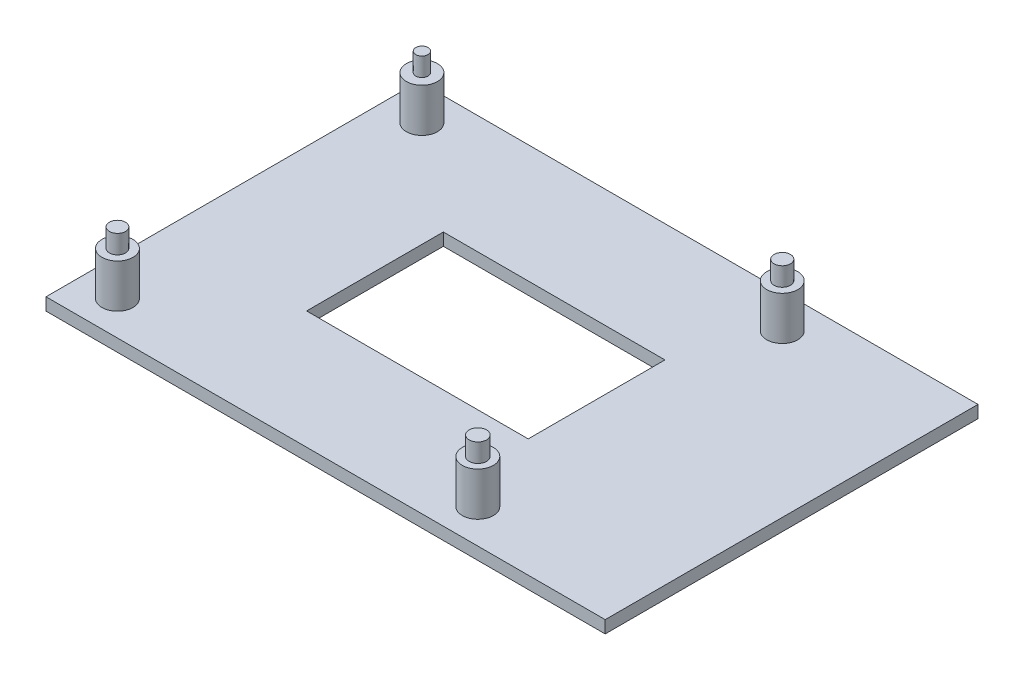
ISO-10303-21;
HEADER;
FILE_DESCRIPTION(('STEP AP214'),'2;1');
FILE_NAME('part.step','',(''),(''),'','','');
FILE_SCHEMA(('AUTOMOTIVE_DESIGN { 1 0 10303 214 1 1 1 1 }'));
ENDSEC;
DATA;
#1=APPLICATION_CONTEXT('core data for automotive mechanical design processes');
#2=APPLICATION_PROTOCOL_DEFINITION('international standard','automotive_design',2000,#1);
#3=PRODUCT_CONTEXT('',#1,'mechanical');
#4=PRODUCT('Part','Part','',(#3));
#5=PRODUCT_RELATED_PRODUCT_CATEGORY('part','',(#4));
#6=PRODUCT_DEFINITION_FORMATION('','',#4);
#7=PRODUCT_DEFINITION_CONTEXT('part definition',#1,'design');
#8=PRODUCT_DEFINITION('design','',#6,#7);
#9=PRODUCT_DEFINITION_SHAPE('','',#8);
#10=(LENGTH_UNIT() NAMED_UNIT(*) SI_UNIT(.MILLI.,.METRE.));
#11=(NAMED_UNIT(*) PLANE_ANGLE_UNIT() SI_UNIT($,.RADIAN.));
#12=(NAMED_UNIT(*) SI_UNIT($,.STERADIAN.) SOLID_ANGLE_UNIT());
#13=UNCERTAINTY_MEASURE_WITH_UNIT(LENGTH_MEASURE(1.E-05),#10,'distance_accuracy_value','');
#14=(GEOMETRIC_REPRESENTATION_CONTEXT(3) GLOBAL_UNCERTAINTY_ASSIGNED_CONTEXT((#13)) GLOBAL_UNIT_ASSIGNED_CONTEXT((#10,
#11,#12)) REPRESENTATION_CONTEXT('',''));
#15=CARTESIAN_POINT('',(0.,0.,0.));
#16=DIRECTION('',(0.,0.,1.));
#17=DIRECTION('',(1.,0.,0.));
#18=AXIS2_PLACEMENT_3D('',#15,#16,#17);
#19=CARTESIAN_POINT('',(-39.,9.,24.5));
#20=DIRECTION('',(0.,1.,0.));
#21=DIRECTION('',(0.,0.,1.));
#22=AXIS2_PLACEMENT_3D('',#19,#20,#21);
#23=PLANE('',#22);
#24=CARTESIAN_POINT('',(-39.,9.,24.5));
#25=DIRECTION('',(0.,1.,0.));
#26=DIRECTION('',(0.,0.,1.));
#27=AXIS2_PLACEMENT_3D('',#24,#25,#26);
#28=CIRCLE('',#27,2.5);
#29=CARTESIAN_POINT('',(-39.,9.,27.));
#30=VERTEX_POINT('',#29);
#31=EDGE_CURVE('E151',#30,#30,#28,.T.);
#32=ORIENTED_EDGE('',*,*,#31,.T.);
#33=EDGE_LOOP('',(#32));
#34=FACE_BOUND('',#33,.T.);
#35=CARTESIAN_POINT('',(-39.,9.,24.5));
#36=DIRECTION('',(0.,1.,0.));
#37=DIRECTION('',(0.,0.,1.));
#38=AXIS2_PLACEMENT_3D('',#35,#36,#37);
#39=CIRCLE('',#38,1.29465675280801);
#40=CARTESIAN_POINT('',(-39.,9.,25.794656752808));
#41=VERTEX_POINT('',#40);
#42=EDGE_CURVE('E124',#41,#41,#39,.T.);
#43=ORIENTED_EDGE('',*,*,#42,.F.);
#44=EDGE_LOOP('',(#43));
#45=FACE_BOUND('',#44,.T.);
#46=ADVANCED_FACE('F33',(#34,#45),#23,.T.);
#47=CARTESIAN_POINT('',(19.,9.,24.5));
#48=DIRECTION('',(0.,1.,0.));
#49=DIRECTION('',(0.,0.,1.));
#50=AXIS2_PLACEMENT_3D('',#47,#48,#49);
#51=PLANE('',#50);
#52=CARTESIAN_POINT('',(19.,9.,24.5));
#53=DIRECTION('',(0.,1.,0.));
#54=DIRECTION('',(0.,0.,1.));
#55=AXIS2_PLACEMENT_3D('',#52,#53,#54);
#56=CIRCLE('',#55,2.5);
#57=CARTESIAN_POINT('',(19.,9.,27.));
#58=VERTEX_POINT('',#57);
#59=EDGE_CURVE('E157',#58,#58,#56,.T.);
#60=ORIENTED_EDGE('',*,*,#59,.T.);
#61=EDGE_LOOP('',(#60));
#62=FACE_BOUND('',#61,.T.);
#63=CARTESIAN_POINT('',(19.,9.,24.5));
#64=DIRECTION('',(0.,1.,0.));
#65=DIRECTION('',(0.,0.,1.));
#66=AXIS2_PLACEMENT_3D('',#63,#64,#65);
#67=CIRCLE('',#66,1.39954114804982);
#68=CARTESIAN_POINT('',(19.,9.,25.8995411480498));
#69=VERTEX_POINT('',#68);
#70=EDGE_CURVE('E130',#69,#69,#67,.T.);
#71=ORIENTED_EDGE('',*,*,#70,.F.);
#72=EDGE_LOOP('',(#71));
#73=FACE_BOUND('',#72,.T.);
#74=ADVANCED_FACE('F227',(#62,#73),#51,.T.);
#75=CARTESIAN_POINT('',(19.,9.,-24.5));
#76=DIRECTION('',(0.,1.,0.));
#77=DIRECTION('',(0.,0.,1.));
#78=AXIS2_PLACEMENT_3D('',#75,#76,#77);
#79=PLANE('',#78);
#80=CARTESIAN_POINT('',(19.,9.,-24.5));
#81=DIRECTION('',(0.,1.,0.));
#82=DIRECTION('',(0.,0.,1.));
#83=AXIS2_PLACEMENT_3D('',#80,#81,#82);
#84=CIRCLE('',#83,2.5);
#85=CARTESIAN_POINT('',(19.,9.,-22.));
#86=VERTEX_POINT('',#85);
#87=EDGE_CURVE('E163',#86,#86,#84,.T.);
#88=ORIENTED_EDGE('',*,*,#87,.T.);
#89=EDGE_LOOP('',(#88));
#90=FACE_BOUND('',#89,.T.);
#91=CARTESIAN_POINT('',(19.,9.,-24.5));
#92=DIRECTION('',(0.,1.,0.));
#93=DIRECTION('',(0.,0.,1.));
#94=AXIS2_PLACEMENT_3D('',#91,#92,#93);
#95=CIRCLE('',#94,1.31678764035088);
#96=CARTESIAN_POINT('',(19.,9.,-23.1832123596491));
#97=VERTEX_POINT('',#96);
#98=EDGE_CURVE('E136',#97,#97,#95,.T.);
#99=ORIENTED_EDGE('',*,*,#98,.F.);
#100=EDGE_LOOP('',(#99));
#101=FACE_BOUND('',#100,.T.);
#102=ADVANCED_FACE('F233',(#90,#101),#79,.T.);
#103=CARTESIAN_POINT('',(-39.,9.,-24.5));
#104=DIRECTION('',(0.,1.,0.));
#105=DIRECTION('',(0.,0.,1.));
#106=AXIS2_PLACEMENT_3D('',#103,#104,#105);
#107=PLANE('',#106);
#108=CARTESIAN_POINT('',(-39.,9.,-24.5));
#109=DIRECTION('',(0.,1.,0.));
#110=DIRECTION('',(0.,0.,1.));
#111=AXIS2_PLACEMENT_3D('',#108,#109,#110);
#112=CIRCLE('',#111,2.5);
#113=CARTESIAN_POINT('',(-39.,9.,-22.));
#114=VERTEX_POINT('',#113);
#115=EDGE_CURVE('E169',#114,#114,#112,.T.);
#116=ORIENTED_EDGE('',*,*,#115,.T.);
#117=EDGE_LOOP('',(#116));
#118=FACE_BOUND('',#117,.T.);
#119=CARTESIAN_POINT('',(-39.,9.,-24.5));
#120=DIRECTION('',(0.,1.,0.));
#121=DIRECTION('',(0.,0.,1.));
#122=AXIS2_PLACEMENT_3D('',#119,#120,#121);
#123=CIRCLE('',#122,0.987255519616663);
#124=CARTESIAN_POINT('',(-39.,9.,-23.5127444803833));
#125=VERTEX_POINT('',#124);
#126=EDGE_CURVE('E142',#125,#125,#123,.T.);
#127=ORIENTED_EDGE('',*,*,#126,.F.);
#128=EDGE_LOOP('',(#127));
#129=FACE_BOUND('',#128,.T.);
#130=ADVANCED_FACE('F252',(#118,#129),#107,.T.);
#131=CARTESIAN_POINT('',(0.,2.,0.));
#132=DIRECTION('',(0.,1.,0.));
#133=DIRECTION('',(0.,0.,1.));
#134=AXIS2_PLACEMENT_3D('',#131,#132,#133);
#135=PLANE('',#134);
#136=DIRECTION('',(0.,0.,-1.));
#137=VECTOR('',#136,1.);
#138=CARTESIAN_POINT('',(13.612760015036,2.,-11.0057027414996));
#139=LINE('',#138,#137);
#140=CARTESIAN_POINT('',(13.612760015036,2.,11.0057027414996));
#141=VERTEX_POINT('',#140);
#142=CARTESIAN_POINT('',(13.612760015036,2.,-11.0057027414996));
#143=VERTEX_POINT('',#142);
#144=EDGE_CURVE('E48',#141,#143,#139,.T.);
#145=ORIENTED_EDGE('',*,*,#144,.F.);
#146=DIRECTION('',(1.,0.,0.));
#147=VECTOR('',#146,1.);
#148=CARTESIAN_POINT('',(-22.0537251509541,2.,11.0057027414996));
#149=LINE('',#148,#147);
#150=CARTESIAN_POINT('',(-22.0537251509541,2.,11.0057027414996));
#151=VERTEX_POINT('',#150);
#152=EDGE_CURVE('E117',#151,#141,#149,.T.);
#153=ORIENTED_EDGE('',*,*,#152,.F.);
#154=DIRECTION('',(0.,0.,1.));
#155=VECTOR('',#154,1.);
#156=CARTESIAN_POINT('',(-22.0537251509541,2.,-11.0057027414996));
#157=LINE('',#156,#155);
#158=CARTESIAN_POINT('',(-22.0537251509541,2.,-11.0057027414996));
#159=VERTEX_POINT('',#158);
#160=EDGE_CURVE('E101',#159,#151,#157,.T.);
#161=ORIENTED_EDGE('',*,*,#160,.F.);
#162=DIRECTION('',(-1.,0.,0.));
#163=VECTOR('',#162,1.);
#164=CARTESIAN_POINT('',(-22.0537251509541,2.,-11.0057027414996));
#165=LINE('',#164,#163);
#166=EDGE_CURVE('E110',#143,#159,#165,.T.);
#167=ORIENTED_EDGE('',*,*,#166,.F.);
#168=EDGE_LOOP('',(#145,#153,#161,#167));
#169=FACE_BOUND('',#168,.T.);
#170=CARTESIAN_POINT('',(19.,2.,24.5));
#171=DIRECTION('',(0.,1.,0.));
#172=DIRECTION('',(0.,0.,1.));
#173=AXIS2_PLACEMENT_3D('',#170,#171,#172);
#174=CIRCLE('',#173,2.5);
#175=CARTESIAN_POINT('',(19.,2.,27.));
#176=VERTEX_POINT('',#175);
#177=EDGE_CURVE('E154',#176,#176,#174,.T.);
#178=ORIENTED_EDGE('',*,*,#177,.F.);
#179=EDGE_LOOP('',(#178));
#180=FACE_BOUND('',#179,.T.);
#181=CARTESIAN_POINT('',(-39.,2.,-24.5));
#182=DIRECTION('',(0.,1.,0.));
#183=DIRECTION('',(0.,0.,1.));
#184=AXIS2_PLACEMENT_3D('',#181,#182,#183);
#185=CIRCLE('',#184,2.5);
#186=CARTESIAN_POINT('',(-39.,2.,-22.));
#187=VERTEX_POINT('',#186);
#188=EDGE_CURVE('E166',#187,#187,#185,.T.);
#189=ORIENTED_EDGE('',*,*,#188,.F.);
#190=EDGE_LOOP('',(#189));
#191=FACE_BOUND('',#190,.T.);
#192=DIRECTION('',(0.,0.,-1.));
#193=VECTOR('',#192,1.);
#194=CARTESIAN_POINT('',(45.,2.,-30.));
#195=LINE('',#194,#193);
#196=CARTESIAN_POINT('',(45.,2.,30.));
#197=VERTEX_POINT('',#196);
#198=CARTESIAN_POINT('',(45.,2.,-30.));
#199=VERTEX_POINT('',#198);
#200=EDGE_CURVE('E175',#197,#199,#195,.T.);
#201=ORIENTED_EDGE('',*,*,#200,.T.);
#202=DIRECTION('',(-1.,0.,0.));
#203=VECTOR('',#202,1.);
#204=CARTESIAN_POINT('',(-45.,2.,-30.));
#205=LINE('',#204,#203);
#206=CARTESIAN_POINT('',(-45.,2.,-30.));
#207=VERTEX_POINT('',#206);
#208=EDGE_CURVE('E178',#199,#207,#205,.T.);
#209=ORIENTED_EDGE('',*,*,#208,.T.);
#210=DIRECTION('',(0.,0.,1.));
#211=VECTOR('',#210,1.);
#212=CARTESIAN_POINT('',(-45.,2.,-30.));
#213=LINE('',#212,#211);
#214=CARTESIAN_POINT('',(-45.,2.,30.));
#215=VERTEX_POINT('',#214);
#216=EDGE_CURVE('E181',#207,#215,#213,.T.);
#217=ORIENTED_EDGE('',*,*,#216,.T.);
#218=DIRECTION('',(1.,0.,0.));
#219=VECTOR('',#218,1.);
#220=CARTESIAN_POINT('',(-45.,2.,30.));
#221=LINE('',#220,#219);
#222=EDGE_CURVE('E183',#215,#197,#221,.T.);
#223=ORIENTED_EDGE('',*,*,#222,.T.);
#224=EDGE_LOOP('',(#201,#209,#217,#223));
#225=FACE_BOUND('',#224,.T.);
#226=CARTESIAN_POINT('',(19.,2.,-24.5));
#227=DIRECTION('',(0.,1.,0.));
#228=DIRECTION('',(0.,0.,1.));
#229=AXIS2_PLACEMENT_3D('',#226,#227,#228);
#230=CIRCLE('',#229,2.5);
#231=CARTESIAN_POINT('',(19.,2.,-22.));
#232=VERTEX_POINT('',#231);
#233=EDGE_CURVE('E160',#232,#232,#230,.T.);
#234=ORIENTED_EDGE('',*,*,#233,.F.);
#235=EDGE_LOOP('',(#234));
#236=FACE_BOUND('',#235,.T.);
#237=CARTESIAN_POINT('',(-39.,2.,24.5));
#238=DIRECTION('',(0.,1.,0.));
#239=DIRECTION('',(0.,0.,1.));
#240=AXIS2_PLACEMENT_3D('',#237,#238,#239);
#241=CIRCLE('',#240,2.5);
#242=CARTESIAN_POINT('',(-39.,2.,27.));
#243=VERTEX_POINT('',#242);
#244=EDGE_CURVE('E148',#243,#243,#241,.T.);
#245=ORIENTED_EDGE('',*,*,#244,.F.);
#246=EDGE_LOOP('',(#245));
#247=FACE_BOUND('',#246,.T.);
#248=ADVANCED_FACE('F114',(#169,#180,#191,#225,#236,#247),#135,.T.);
#249=CARTESIAN_POINT('',(45.,2.,-30.));
#250=DIRECTION('',(-1.,0.,0.));
#251=DIRECTION('',(0.,0.,1.));
#252=AXIS2_PLACEMENT_3D('',#249,#250,#251);
#253=PLANE('',#252);
#254=DIRECTION('',(0.,0.,-1.));
#255=VECTOR('',#254,1.);
#256=CARTESIAN_POINT('',(45.,0.,-30.));
#257=LINE('',#256,#255);
#258=CARTESIAN_POINT('',(45.,0.,30.));
#259=VERTEX_POINT('',#258);
#260=CARTESIAN_POINT('',(45.,0.,-30.));
#261=VERTEX_POINT('',#260);
#262=EDGE_CURVE('E172',#259,#261,#257,.T.);
#263=ORIENTED_EDGE('',*,*,#262,.T.);
#264=DIRECTION('',(0.,-1.,0.));
#265=VECTOR('',#264,1.);
#266=CARTESIAN_POINT('',(45.,2.,-30.));
#267=LINE('',#266,#265);
#268=EDGE_CURVE('E201',#199,#261,#267,.T.);
#269=ORIENTED_EDGE('',*,*,#268,.F.);
#270=ORIENTED_EDGE('',*,*,#200,.F.);
#271=DIRECTION('',(0.,-1.,0.));
#272=VECTOR('',#271,1.);
#273=CARTESIAN_POINT('',(45.,2.,30.));
#274=LINE('',#273,#272);
#275=EDGE_CURVE('E185',#197,#259,#274,.T.);
#276=ORIENTED_EDGE('',*,*,#275,.T.);
#277=EDGE_LOOP('',(#263,#269,#270,#276));
#278=FACE_BOUND('',#277,.T.);
#279=ADVANCED_FACE('F35',(#278),#253,.F.);
#280=CARTESIAN_POINT('',(-45.,2.,-30.));
#281=DIRECTION('',(0.,0.,1.));
#282=DIRECTION('',(1.,0.,0.));
#283=AXIS2_PLACEMENT_3D('',#280,#281,#282);
#284=PLANE('',#283);
#285=DIRECTION('',(-1.,0.,0.));
#286=VECTOR('',#285,1.);
#287=CARTESIAN_POINT('',(-45.,0.,-30.));
#288=LINE('',#287,#286);
#289=CARTESIAN_POINT('',(-45.,0.,-30.));
#290=VERTEX_POINT('',#289);
#291=EDGE_CURVE('E188',#261,#290,#288,.T.);
#292=ORIENTED_EDGE('',*,*,#291,.T.);
#293=DIRECTION('',(0.,-1.,0.));
#294=VECTOR('',#293,1.);
#295=CARTESIAN_POINT('',(-45.,2.,-30.));
#296=LINE('',#295,#294);
#297=EDGE_CURVE('E198',#207,#290,#296,.T.);
#298=ORIENTED_EDGE('',*,*,#297,.F.);
#299=ORIENTED_EDGE('',*,*,#208,.F.);
#300=ORIENTED_EDGE('',*,*,#268,.T.);
#301=EDGE_LOOP('',(#292,#298,#299,#300));
#302=FACE_BOUND('',#301,.T.);
#303=ADVANCED_FACE('F274',(#302),#284,.F.);
#304=CARTESIAN_POINT('',(-45.,2.,-30.));
#305=DIRECTION('',(1.,0.,0.));
#306=DIRECTION('',(0.,0.,-1.));
#307=AXIS2_PLACEMENT_3D('',#304,#305,#306);
#308=PLANE('',#307);
#309=DIRECTION('',(0.,0.,1.));
#310=VECTOR('',#309,1.);
#311=CARTESIAN_POINT('',(-45.,0.,-30.));
#312=LINE('',#311,#310);
#313=CARTESIAN_POINT('',(-45.,0.,30.));
#314=VERTEX_POINT('',#313);
#315=EDGE_CURVE('E190',#290,#314,#312,.T.);
#316=ORIENTED_EDGE('',*,*,#315,.T.);
#317=DIRECTION('',(0.,-1.,0.));
#318=VECTOR('',#317,1.);
#319=CARTESIAN_POINT('',(-45.,2.,30.));
#320=LINE('',#319,#318);
#321=EDGE_CURVE('E195',#215,#314,#320,.T.);
#322=ORIENTED_EDGE('',*,*,#321,.F.);
#323=ORIENTED_EDGE('',*,*,#216,.F.);
#324=ORIENTED_EDGE('',*,*,#297,.T.);
#325=EDGE_LOOP('',(#316,#322,#323,#324));
#326=FACE_BOUND('',#325,.T.);
#327=ADVANCED_FACE('F271',(#326),#308,.F.);
#328=CARTESIAN_POINT('',(-45.,2.,30.));
#329=DIRECTION('',(0.,0.,-1.));
#330=DIRECTION('',(-1.,0.,0.));
#331=AXIS2_PLACEMENT_3D('',#328,#329,#330);
#332=PLANE('',#331);
#333=DIRECTION('',(1.,0.,0.));
#334=VECTOR('',#333,1.);
#335=CARTESIAN_POINT('',(-45.,0.,30.));
#336=LINE('',#335,#334);
#337=EDGE_CURVE('E179',#314,#259,#336,.T.);
#338=ORIENTED_EDGE('',*,*,#337,.T.);
#339=ORIENTED_EDGE('',*,*,#275,.F.);
#340=ORIENTED_EDGE('',*,*,#222,.F.);
#341=ORIENTED_EDGE('',*,*,#321,.T.);
#342=EDGE_LOOP('',(#338,#339,#340,#341));
#343=FACE_BOUND('',#342,.T.);
#344=ADVANCED_FACE('F268',(#343),#332,.F.);
#345=CARTESIAN_POINT('',(0.,0.,0.));
#346=DIRECTION('',(0.,1.,0.));
#347=DIRECTION('',(0.,0.,1.));
#348=AXIS2_PLACEMENT_3D('',#345,#346,#347);
#349=PLANE('',#348);
#350=DIRECTION('',(1.,0.,0.));
#351=VECTOR('',#350,1.);
#352=CARTESIAN_POINT('',(0.,0.,11.0057027414996));
#353=LINE('',#352,#351);
#354=CARTESIAN_POINT('',(-22.0537251509541,0.,11.0057027414996));
#355=VERTEX_POINT('',#354);
#356=CARTESIAN_POINT('',(13.612760015036,0.,11.0057027414996));
#357=VERTEX_POINT('',#356);
#358=EDGE_CURVE('E41',#355,#357,#353,.T.);
#359=ORIENTED_EDGE('',*,*,#358,.T.);
#360=DIRECTION('',(0.,0.,-1.));
#361=VECTOR('',#360,1.);
#362=CARTESIAN_POINT('',(13.612760015036,0.,0.));
#363=LINE('',#362,#361);
#364=CARTESIAN_POINT('',(13.612760015036,0.,-11.0057027414996));
#365=VERTEX_POINT('',#364);
#366=EDGE_CURVE('E11',#357,#365,#363,.T.);
#367=ORIENTED_EDGE('',*,*,#366,.T.);
#368=DIRECTION('',(-1.,0.,0.));
#369=VECTOR('',#368,1.);
#370=CARTESIAN_POINT('',(0.,0.,-11.0057027414996));
#371=LINE('',#370,#369);
#372=CARTESIAN_POINT('',(-22.0537251509541,0.,-11.0057027414996));
#373=VERTEX_POINT('',#372);
#374=EDGE_CURVE('E204',#365,#373,#371,.T.);
#375=ORIENTED_EDGE('',*,*,#374,.T.);
#376=DIRECTION('',(0.,0.,1.));
#377=VECTOR('',#376,1.);
#378=CARTESIAN_POINT('',(-22.0537251509541,0.,0.));
#379=LINE('',#378,#377);
#380=EDGE_CURVE('E104',#373,#355,#379,.T.);
#381=ORIENTED_EDGE('',*,*,#380,.T.);
#382=EDGE_LOOP('',(#359,#367,#375,#381));
#383=FACE_BOUND('',#382,.T.);
#384=ORIENTED_EDGE('',*,*,#262,.F.);
#385=ORIENTED_EDGE('',*,*,#337,.F.);
#386=ORIENTED_EDGE('',*,*,#315,.F.);
#387=ORIENTED_EDGE('',*,*,#291,.F.);
#388=EDGE_LOOP('',(#384,#385,#386,#387));
#389=FACE_BOUND('',#388,.T.);
#390=ADVANCED_FACE('F208',(#383,#389),#349,.F.);
#391=CARTESIAN_POINT('',(-39.,9.,-24.5));
#392=DIRECTION('',(0.,-1.,0.));
#393=DIRECTION('',(0.,0.,-1.));
#394=AXIS2_PLACEMENT_3D('',#391,#392,#393);
#395=CYLINDRICAL_SURFACE('',#394,2.5);
#396=ORIENTED_EDGE('',*,*,#115,.F.);
#397=EDGE_LOOP('',(#396));
#398=FACE_BOUND('',#397,.T.);
#399=ORIENTED_EDGE('',*,*,#188,.T.);
#400=EDGE_LOOP('',(#399));
#401=FACE_BOUND('',#400,.T.);
#402=ADVANCED_FACE('F256',(#398,#401),#395,.T.);
#403=CARTESIAN_POINT('',(19.,9.,-24.5));
#404=DIRECTION('',(0.,-1.,0.));
#405=DIRECTION('',(0.,0.,-1.));
#406=AXIS2_PLACEMENT_3D('',#403,#404,#405);
#407=CYLINDRICAL_SURFACE('',#406,2.5);
#408=ORIENTED_EDGE('',*,*,#87,.F.);
#409=EDGE_LOOP('',(#408));
#410=FACE_BOUND('',#409,.T.);
#411=ORIENTED_EDGE('',*,*,#233,.T.);
#412=EDGE_LOOP('',(#411));
#413=FACE_BOUND('',#412,.T.);
#414=ADVANCED_FACE('F248',(#410,#413),#407,.T.);
#415=CARTESIAN_POINT('',(19.,9.,24.5));
#416=DIRECTION('',(0.,-1.,0.));
#417=DIRECTION('',(0.,0.,-1.));
#418=AXIS2_PLACEMENT_3D('',#415,#416,#417);
#419=CYLINDRICAL_SURFACE('',#418,2.5);
#420=ORIENTED_EDGE('',*,*,#59,.F.);
#421=EDGE_LOOP('',(#420));
#422=FACE_BOUND('',#421,.T.);
#423=ORIENTED_EDGE('',*,*,#177,.T.);
#424=EDGE_LOOP('',(#423));
#425=FACE_BOUND('',#424,.T.);
#426=ADVANCED_FACE('F243',(#422,#425),#419,.T.);
#427=CARTESIAN_POINT('',(-39.,9.,24.5));
#428=DIRECTION('',(0.,-1.,0.));
#429=DIRECTION('',(0.,0.,-1.));
#430=AXIS2_PLACEMENT_3D('',#427,#428,#429);
#431=CYLINDRICAL_SURFACE('',#430,2.5);
#432=ORIENTED_EDGE('',*,*,#31,.F.);
#433=EDGE_LOOP('',(#432));
#434=FACE_BOUND('',#433,.T.);
#435=ORIENTED_EDGE('',*,*,#244,.T.);
#436=EDGE_LOOP('',(#435));
#437=FACE_BOUND('',#436,.T.);
#438=ADVANCED_FACE('F241',(#434,#437),#431,.T.);
#439=CARTESIAN_POINT('',(-39.,12.,-24.5));
#440=DIRECTION('',(0.,-1.,0.));
#441=DIRECTION('',(0.,0.,-1.));
#442=AXIS2_PLACEMENT_3D('',#439,#440,#441);
#443=CYLINDRICAL_SURFACE('',#442,0.987255519616663);
#444=CARTESIAN_POINT('',(-39.,12.,-24.5));
#445=DIRECTION('',(0.,1.,0.));
#446=DIRECTION('',(0.,0.,1.));
#447=AXIS2_PLACEMENT_3D('',#444,#445,#446);
#448=CIRCLE('',#447,0.987255519616663);
#449=CARTESIAN_POINT('',(-39.,12.,-23.5127444803833));
#450=VERTEX_POINT('',#449);
#451=EDGE_CURVE('E145',#450,#450,#448,.T.);
#452=ORIENTED_EDGE('',*,*,#451,.F.);
#453=EDGE_LOOP('',(#452));
#454=FACE_BOUND('',#453,.T.);
#455=ORIENTED_EDGE('',*,*,#126,.T.);
#456=EDGE_LOOP('',(#455));
#457=FACE_BOUND('',#456,.T.);
#458=ADVANCED_FACE('F239',(#454,#457),#443,.T.);
#459=CARTESIAN_POINT('',(-39.,12.,-24.5));
#460=DIRECTION('',(0.,1.,0.));
#461=DIRECTION('',(0.,0.,1.));
#462=AXIS2_PLACEMENT_3D('',#459,#460,#461);
#463=PLANE('',#462);
#464=ORIENTED_EDGE('',*,*,#451,.T.);
#465=EDGE_LOOP('',(#464));
#466=FACE_BOUND('',#465,.T.);
#467=ADVANCED_FACE('F448',(#466),#463,.T.);
#468=CARTESIAN_POINT('',(19.,12.,-24.5));
#469=DIRECTION('',(0.,-1.,0.));
#470=DIRECTION('',(0.,0.,-1.));
#471=AXIS2_PLACEMENT_3D('',#468,#469,#470);
#472=CYLINDRICAL_SURFACE('',#471,1.31678764035088);
#473=CARTESIAN_POINT('',(19.,12.,-24.5));
#474=DIRECTION('',(0.,1.,0.));
#475=DIRECTION('',(0.,0.,1.));
#476=AXIS2_PLACEMENT_3D('',#473,#474,#475);
#477=CIRCLE('',#476,1.31678764035088);
#478=CARTESIAN_POINT('',(19.,12.,-23.1832123596491));
#479=VERTEX_POINT('',#478);
#480=EDGE_CURVE('E139',#479,#479,#477,.T.);
#481=ORIENTED_EDGE('',*,*,#480,.F.);
#482=EDGE_LOOP('',(#481));
#483=FACE_BOUND('',#482,.T.);
#484=ORIENTED_EDGE('',*,*,#98,.T.);
#485=EDGE_LOOP('',(#484));
#486=FACE_BOUND('',#485,.T.);
#487=ADVANCED_FACE('F439',(#483,#486),#472,.T.);
#488=CARTESIAN_POINT('',(19.,12.,-24.5));
#489=DIRECTION('',(0.,1.,0.));
#490=DIRECTION('',(0.,0.,1.));
#491=AXIS2_PLACEMENT_3D('',#488,#489,#490);
#492=PLANE('',#491);
#493=ORIENTED_EDGE('',*,*,#480,.T.);
#494=EDGE_LOOP('',(#493));
#495=FACE_BOUND('',#494,.T.);
#496=ADVANCED_FACE('F430',(#495),#492,.T.);
#497=CARTESIAN_POINT('',(19.,12.,24.5));
#498=DIRECTION('',(0.,-1.,0.));
#499=DIRECTION('',(0.,0.,-1.));
#500=AXIS2_PLACEMENT_3D('',#497,#498,#499);
#501=CYLINDRICAL_SURFACE('',#500,1.39954114804982);
#502=CARTESIAN_POINT('',(19.,12.,24.5));
#503=DIRECTION('',(0.,1.,0.));
#504=DIRECTION('',(0.,0.,1.));
#505=AXIS2_PLACEMENT_3D('',#502,#503,#504);
#506=CIRCLE('',#505,1.39954114804982);
#507=CARTESIAN_POINT('',(19.,12.,25.8995411480498));
#508=VERTEX_POINT('',#507);
#509=EDGE_CURVE('E133',#508,#508,#506,.T.);
#510=ORIENTED_EDGE('',*,*,#509,.F.);
#511=EDGE_LOOP('',(#510));
#512=FACE_BOUND('',#511,.T.);
#513=ORIENTED_EDGE('',*,*,#70,.T.);
#514=EDGE_LOOP('',(#513));
#515=FACE_BOUND('',#514,.T.);
#516=ADVANCED_FACE('F421',(#512,#515),#501,.T.);
#517=CARTESIAN_POINT('',(19.,12.,24.5));
#518=DIRECTION('',(0.,1.,0.));
#519=DIRECTION('',(0.,0.,1.));
#520=AXIS2_PLACEMENT_3D('',#517,#518,#519);
#521=PLANE('',#520);
#522=ORIENTED_EDGE('',*,*,#509,.T.);
#523=EDGE_LOOP('',(#522));
#524=FACE_BOUND('',#523,.T.);
#525=ADVANCED_FACE('F412',(#524),#521,.T.);
#526=CARTESIAN_POINT('',(-39.,12.,24.5));
#527=DIRECTION('',(0.,-1.,0.));
#528=DIRECTION('',(0.,0.,-1.));
#529=AXIS2_PLACEMENT_3D('',#526,#527,#528);
#530=CYLINDRICAL_SURFACE('',#529,1.29465675280801);
#531=CARTESIAN_POINT('',(-39.,12.,24.5));
#532=DIRECTION('',(0.,1.,0.));
#533=DIRECTION('',(0.,0.,1.));
#534=AXIS2_PLACEMENT_3D('',#531,#532,#533);
#535=CIRCLE('',#534,1.29465675280801);
#536=CARTESIAN_POINT('',(-39.,12.,25.794656752808));
#537=VERTEX_POINT('',#536);
#538=EDGE_CURVE('E127',#537,#537,#535,.T.);
#539=ORIENTED_EDGE('',*,*,#538,.F.);
#540=EDGE_LOOP('',(#539));
#541=FACE_BOUND('',#540,.T.);
#542=ORIENTED_EDGE('',*,*,#42,.T.);
#543=EDGE_LOOP('',(#542));
#544=FACE_BOUND('',#543,.T.);
#545=ADVANCED_FACE('F222',(#541,#544),#530,.T.);
#546=CARTESIAN_POINT('',(-39.,12.,24.5));
#547=DIRECTION('',(0.,1.,0.));
#548=DIRECTION('',(0.,0.,1.));
#549=AXIS2_PLACEMENT_3D('',#546,#547,#548);
#550=PLANE('',#549);
#551=ORIENTED_EDGE('',*,*,#538,.T.);
#552=EDGE_LOOP('',(#551));
#553=FACE_BOUND('',#552,.T.);
#554=ADVANCED_FACE('F215',(#553),#550,.T.);
#555=CARTESIAN_POINT('',(13.612760015036,-1.,-11.0057027414996));
#556=DIRECTION('',(1.,0.,0.));
#557=DIRECTION('',(0.,0.,-1.));
#558=AXIS2_PLACEMENT_3D('',#555,#556,#557);
#559=PLANE('',#558);
#560=DIRECTION('',(0.,1.,0.));
#561=VECTOR('',#560,1.);
#562=CARTESIAN_POINT('',(13.612760015036,-1.,11.0057027414996));
#563=LINE('',#562,#561);
#564=EDGE_CURVE('E122',#357,#141,#563,.T.);
#565=ORIENTED_EDGE('',*,*,#564,.T.);
#566=ORIENTED_EDGE('',*,*,#144,.T.);
#567=DIRECTION('',(0.,1.,0.));
#568=VECTOR('',#567,1.);
#569=CARTESIAN_POINT('',(13.612760015036,-1.,-11.0057027414996));
#570=LINE('',#569,#568);
#571=EDGE_CURVE('E107',#365,#143,#570,.T.);
#572=ORIENTED_EDGE('',*,*,#571,.F.);
#573=ORIENTED_EDGE('',*,*,#366,.F.);
#574=EDGE_LOOP('',(#565,#566,#572,#573));
#575=FACE_BOUND('',#574,.T.);
#576=ADVANCED_FACE('F213',(#575),#559,.F.);
#577=CARTESIAN_POINT('',(-22.0537251509541,-1.,11.0057027414996));
#578=DIRECTION('',(0.,0.,1.));
#579=DIRECTION('',(1.,0.,0.));
#580=AXIS2_PLACEMENT_3D('',#577,#578,#579);
#581=PLANE('',#580);
#582=DIRECTION('',(0.,1.,0.));
#583=VECTOR('',#582,1.);
#584=CARTESIAN_POINT('',(-22.0537251509541,-1.,11.0057027414996));
#585=LINE('',#584,#583);
#586=EDGE_CURVE('E106',#355,#151,#585,.T.);
#587=ORIENTED_EDGE('',*,*,#586,.T.);
#588=ORIENTED_EDGE('',*,*,#152,.T.);
#589=ORIENTED_EDGE('',*,*,#564,.F.);
#590=ORIENTED_EDGE('',*,*,#358,.F.);
#591=EDGE_LOOP('',(#587,#588,#589,#590));
#592=FACE_BOUND('',#591,.T.);
#593=ADVANCED_FACE('F212',(#592),#581,.F.);
#594=CARTESIAN_POINT('',(-22.0537251509541,-1.,-11.0057027414996));
#595=DIRECTION('',(-1.,0.,0.));
#596=DIRECTION('',(0.,0.,1.));
#597=AXIS2_PLACEMENT_3D('',#594,#595,#596);
#598=PLANE('',#597);
#599=DIRECTION('',(0.,1.,0.));
#600=VECTOR('',#599,1.);
#601=CARTESIAN_POINT('',(-22.0537251509541,-1.,-11.0057027414996));
#602=LINE('',#601,#600);
#603=EDGE_CURVE('E56',#373,#159,#602,.T.);
#604=ORIENTED_EDGE('',*,*,#603,.T.);
#605=ORIENTED_EDGE('',*,*,#160,.T.);
#606=ORIENTED_EDGE('',*,*,#586,.F.);
#607=ORIENTED_EDGE('',*,*,#380,.F.);
#608=EDGE_LOOP('',(#604,#605,#606,#607));
#609=FACE_BOUND('',#608,.T.);
#610=ADVANCED_FACE('F98',(#609),#598,.F.);
#611=CARTESIAN_POINT('',(-22.0537251509541,-1.,-11.0057027414996));
#612=DIRECTION('',(0.,0.,-1.));
#613=DIRECTION('',(-1.,0.,0.));
#614=AXIS2_PLACEMENT_3D('',#611,#612,#613);
#615=PLANE('',#614);
#616=ORIENTED_EDGE('',*,*,#571,.T.);
#617=ORIENTED_EDGE('',*,*,#166,.T.);
#618=ORIENTED_EDGE('',*,*,#603,.F.);
#619=ORIENTED_EDGE('',*,*,#374,.F.);
#620=EDGE_LOOP('',(#616,#617,#618,#619));
#621=FACE_BOUND('',#620,.T.);
#622=ADVANCED_FACE('F111',(#621),#615,.F.);
#623=CLOSED_SHELL('',(#46,#74,#102,#130,#248,#279,#303,#327,#344,#390,#402,#414,#426,#438,#458,
#467,#487,#496,#516,#525,#545,#554,#576,#593,#610,#622));
#624=MANIFOLD_SOLID_BREP('B2',#623);
#625=ADVANCED_BREP_SHAPE_REPRESENTATION('',(#18,#624),#14);
#626=SHAPE_DEFINITION_REPRESENTATION(#9,#625);
ENDSEC;
END-ISO-10303-21;
